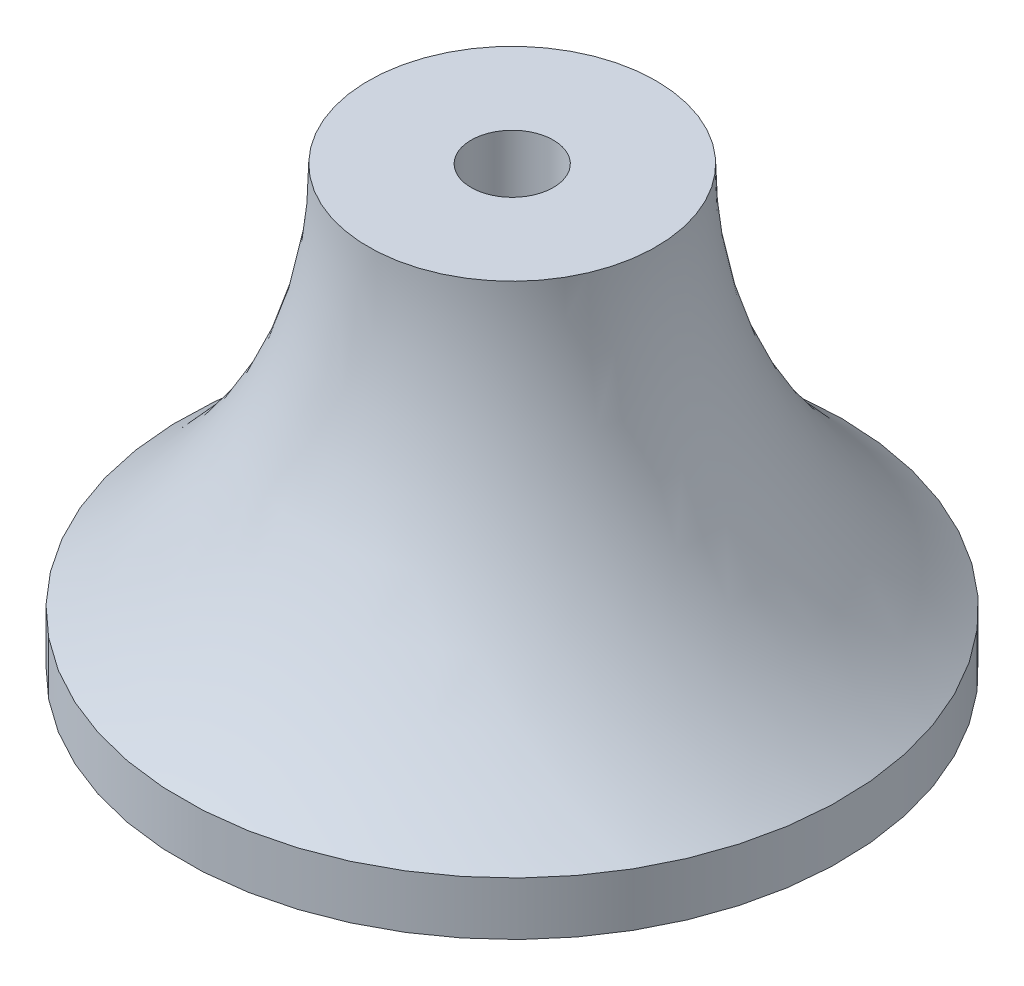
ISO-10303-21;
HEADER;
FILE_DESCRIPTION(('STEP AP214'),'2;1');
FILE_NAME('part.step','',(''),(''),'','','');
FILE_SCHEMA(('AUTOMOTIVE_DESIGN { 1 0 10303 214 1 1 1 1 }'));
ENDSEC;
DATA;
#1=APPLICATION_CONTEXT('core data for automotive mechanical design processes');
#2=APPLICATION_PROTOCOL_DEFINITION('international standard','automotive_design',2000,#1);
#3=PRODUCT_CONTEXT('',#1,'mechanical');
#4=PRODUCT('Part','Part','',(#3));
#5=PRODUCT_RELATED_PRODUCT_CATEGORY('part','',(#4));
#6=PRODUCT_DEFINITION_FORMATION('','',#4);
#7=PRODUCT_DEFINITION_CONTEXT('part definition',#1,'design');
#8=PRODUCT_DEFINITION('design','',#6,#7);
#9=PRODUCT_DEFINITION_SHAPE('','',#8);
#10=(LENGTH_UNIT() NAMED_UNIT(*) SI_UNIT(.MILLI.,.METRE.));
#11=(NAMED_UNIT(*) PLANE_ANGLE_UNIT() SI_UNIT($,.RADIAN.));
#12=(NAMED_UNIT(*) SI_UNIT($,.STERADIAN.) SOLID_ANGLE_UNIT());
#13=UNCERTAINTY_MEASURE_WITH_UNIT(LENGTH_MEASURE(1.E-05),#10,'distance_accuracy_value','');
#14=(GEOMETRIC_REPRESENTATION_CONTEXT(3) GLOBAL_UNCERTAINTY_ASSIGNED_CONTEXT((#13)) GLOBAL_UNIT_ASSIGNED_CONTEXT((#10,
#11,#12)) REPRESENTATION_CONTEXT('',''));
#15=CARTESIAN_POINT('',(0.,0.,0.));
#16=DIRECTION('',(0.,0.,1.));
#17=DIRECTION('',(1.,0.,0.));
#18=AXIS2_PLACEMENT_3D('',#15,#16,#17);
#19=CARTESIAN_POINT('',(0.,0.,0.));
#20=DIRECTION('',(0.,-1.,0.));
#21=DIRECTION('',(0.,0.,-1.));
#22=AXIS2_PLACEMENT_3D('',#19,#20,#21);
#23=CYLINDRICAL_SURFACE('',#22,2.032);
#24=CARTESIAN_POINT('',(0.,19.05,0.));
#25=DIRECTION('',(0.,-1.,0.));
#26=DIRECTION('',(0.,0.,-1.));
#27=AXIS2_PLACEMENT_3D('',#24,#25,#26);
#28=CIRCLE('',#27,2.032);
#29=CARTESIAN_POINT('',(0.,19.05,-2.032));
#30=VERTEX_POINT('',#29);
#31=EDGE_CURVE('E45',#30,#30,#28,.T.);
#32=ORIENTED_EDGE('',*,*,#31,.F.);
#33=EDGE_LOOP('',(#32));
#34=FACE_BOUND('',#33,.T.);
#35=CARTESIAN_POINT('',(0.,13.462,0.));
#36=DIRECTION('',(0.,-1.,0.));
#37=DIRECTION('',(0.,0.,-1.));
#38=AXIS2_PLACEMENT_3D('',#35,#36,#37);
#39=CIRCLE('',#38,2.032);
#40=CARTESIAN_POINT('',(0.,13.462,-2.032));
#41=VERTEX_POINT('',#40);
#42=EDGE_CURVE('E40',#41,#41,#39,.F.);
#43=ORIENTED_EDGE('',*,*,#42,.F.);
#44=EDGE_LOOP('',(#43));
#45=FACE_BOUND('',#44,.T.);
#46=ADVANCED_FACE('F36',(#34,#45),#23,.F.);
#47=CARTESIAN_POINT('',(0.,19.05,0.));
#48=DIRECTION('',(0.,-1.,0.));
#49=DIRECTION('',(0.,0.,-1.));
#50=AXIS2_PLACEMENT_3D('',#47,#48,#49);
#51=TOROIDAL_SURFACE('',#50,31.4619348413196,24.3499348413196);
#52=CARTESIAN_POINT('',(0.,0.,0.));
#53=DIRECTION('',(0.,-1.,0.));
#54=DIRECTION('',(0.,0.,-1.));
#55=AXIS2_PLACEMENT_3D('',#52,#53,#54);
#56=CIRCLE('',#55,16.2956292009696);
#57=CARTESIAN_POINT('',(0.,0.,-16.2956292009696));
#58=VERTEX_POINT('',#57);
#59=EDGE_CURVE('E138',#58,#58,#56,.T.);
#60=ORIENTED_EDGE('',*,*,#59,.F.);
#61=EDGE_LOOP('',(#60));
#62=FACE_BOUND('',#61,.T.);
#63=CARTESIAN_POINT('',(0.,19.05,0.));
#64=DIRECTION('',(0.,-1.,0.));
#65=DIRECTION('',(0.,0.,-1.));
#66=AXIS2_PLACEMENT_3D('',#63,#64,#65);
#67=CIRCLE('',#66,7.112);
#68=CARTESIAN_POINT('',(0.,19.05,-7.112));
#69=VERTEX_POINT('',#68);
#70=EDGE_CURVE('E12',#69,#69,#67,.T.);
#71=ORIENTED_EDGE('',*,*,#70,.T.);
#72=EDGE_LOOP('',(#71));
#73=FACE_BOUND('',#72,.T.);
#74=ADVANCED_FACE('F38',(#62,#73),#51,.F.);
#75=CARTESIAN_POINT('',(0.,19.05,0.));
#76=DIRECTION('',(0.,-1.,0.));
#77=DIRECTION('',(0.,0.,-1.));
#78=AXIS2_PLACEMENT_3D('',#75,#76,#77);
#79=PLANE('',#78);
#80=ORIENTED_EDGE('',*,*,#70,.F.);
#81=EDGE_LOOP('',(#80));
#82=FACE_BOUND('',#81,.T.);
#83=ORIENTED_EDGE('',*,*,#31,.T.);
#84=EDGE_LOOP('',(#83));
#85=FACE_BOUND('',#84,.T.);
#86=ADVANCED_FACE('F147',(#82,#85),#79,.F.);
#87=CARTESIAN_POINT('',(0.,-2.63421929682295,0.));
#88=DIRECTION('',(0.,-1.,0.));
#89=DIRECTION('',(0.,0.,-1.));
#90=AXIS2_PLACEMENT_3D('',#87,#88,#89);
#91=PLANE('',#90);
#92=DIRECTION('',(0.397934450632884,0.,0.917413850451095));
#93=VECTOR('',#92,1.);
#94=CARTESIAN_POINT('',(2.88200941409084,-2.63421929682295,-3.88758662116894));
#95=LINE('',#94,#93);
#96=CARTESIAN_POINT('',(2.88200941409084,-2.63421929682295,-3.88758662116894));
#97=VERTEX_POINT('',#96);
#98=CARTESIAN_POINT('',(4.80775348039024,-2.63421929682295,0.552100055964106));
#99=VERTEX_POINT('',#98);
#100=EDGE_CURVE('E52',#97,#99,#95,.T.);
#101=ORIENTED_EDGE('',*,*,#100,.F.);
#102=DIRECTION('',(0.993470925590789,0.,0.114085581936465));
#103=VECTOR('',#102,1.);
#104=CARTESIAN_POINT('',(-1.92574406629939,-2.63421929682295,-4.43968667713305));
#105=LINE('',#104,#103);
#106=CARTESIAN_POINT('',(-1.92574406629939,-2.63421929682295,-4.43968667713305));
#107=VERTEX_POINT('',#106);
#108=EDGE_CURVE('E126',#107,#97,#105,.T.);
#109=ORIENTED_EDGE('',*,*,#108,.F.);
#110=DIRECTION('',(0.595536474957904,0.,-0.80332826851463));
#111=VECTOR('',#110,1.);
#112=CARTESIAN_POINT('',(-4.80775348039024,-2.63421929682295,-0.552100055964107));
#113=LINE('',#112,#111);
#114=CARTESIAN_POINT('',(-4.80775348039024,-2.63421929682295,-0.552100055964107));
#115=VERTEX_POINT('',#114);
#116=EDGE_CURVE('E120',#115,#107,#113,.T.);
#117=ORIENTED_EDGE('',*,*,#116,.F.);
#118=DIRECTION('',(-0.397934450632884,0.,-0.917413850451095));
#119=VECTOR('',#118,1.);
#120=CARTESIAN_POINT('',(-2.88200941409084,-2.63421929682295,3.88758662116894));
#121=LINE('',#120,#119);
#122=CARTESIAN_POINT('',(-2.88200941409084,-2.63421929682295,3.88758662116894));
#123=VERTEX_POINT('',#122);
#124=EDGE_CURVE('E118',#123,#115,#121,.T.);
#125=ORIENTED_EDGE('',*,*,#124,.F.);
#126=DIRECTION('',(-0.993470925590788,0.,-0.114085581936466));
#127=VECTOR('',#126,1.);
#128=CARTESIAN_POINT('',(1.92574406629939,-2.63421929682295,4.43968667713305));
#129=LINE('',#128,#127);
#130=CARTESIAN_POINT('',(1.92574406629939,-2.63421929682295,4.43968667713305));
#131=VERTEX_POINT('',#130);
#132=EDGE_CURVE('E103',#131,#123,#129,.T.);
#133=ORIENTED_EDGE('',*,*,#132,.F.);
#134=DIRECTION('',(-0.595536474957904,0.,0.80332826851463));
#135=VECTOR('',#134,1.);
#136=CARTESIAN_POINT('',(4.80775348039024,-2.63421929682295,0.552100055964106));
#137=LINE('',#136,#135);
#138=EDGE_CURVE('E110',#99,#131,#137,.T.);
#139=ORIENTED_EDGE('',*,*,#138,.F.);
#140=EDGE_LOOP('',(#101,#109,#117,#125,#133,#139));
#141=FACE_BOUND('',#140,.T.);
#142=CARTESIAN_POINT('',(0.,-2.63421929682295,0.));
#143=DIRECTION('',(0.,-1.,0.));
#144=DIRECTION('',(0.,0.,-1.));
#145=AXIS2_PLACEMENT_3D('',#142,#143,#144);
#146=CIRCLE('',#145,16.2956292009696);
#147=CARTESIAN_POINT('',(0.,-2.63421929682295,-16.2956292009696));
#148=VERTEX_POINT('',#147);
#149=EDGE_CURVE('E141',#148,#148,#146,.T.);
#150=ORIENTED_EDGE('',*,*,#149,.T.);
#151=EDGE_LOOP('',(#150));
#152=FACE_BOUND('',#151,.T.);
#153=ADVANCED_FACE('F114',(#141,#152),#91,.T.);
#154=CARTESIAN_POINT('',(0.,0.,0.));
#155=DIRECTION('',(0.,-1.,0.));
#156=DIRECTION('',(0.,0.,-1.));
#157=AXIS2_PLACEMENT_3D('',#154,#155,#156);
#158=CYLINDRICAL_SURFACE('',#157,16.2956292009696);
#159=ORIENTED_EDGE('',*,*,#149,.F.);
#160=EDGE_LOOP('',(#159));
#161=FACE_BOUND('',#160,.T.);
#162=ORIENTED_EDGE('',*,*,#59,.T.);
#163=EDGE_LOOP('',(#162));
#164=FACE_BOUND('',#163,.T.);
#165=ADVANCED_FACE('F158',(#161,#164),#158,.T.);
#166=CARTESIAN_POINT('',(0.,13.462,0.));
#167=DIRECTION('',(0.,-1.,0.));
#168=DIRECTION('',(0.,0.,-1.));
#169=AXIS2_PLACEMENT_3D('',#166,#167,#168);
#170=PLANE('',#169);
#171=DIRECTION('',(-0.397934450632884,0.,-0.917413850451095));
#172=VECTOR('',#171,1.);
#173=CARTESIAN_POINT('',(2.88200941409084,13.462,-3.88758662116894));
#174=LINE('',#173,#172);
#175=CARTESIAN_POINT('',(4.80775348039024,13.462,0.552100055964106));
#176=VERTEX_POINT('',#175);
#177=CARTESIAN_POINT('',(2.88200941409084,13.462,-3.88758662116894));
#178=VERTEX_POINT('',#177);
#179=EDGE_CURVE('E71',#176,#178,#174,.T.);
#180=ORIENTED_EDGE('',*,*,#179,.F.);
#181=DIRECTION('',(0.595536474957904,0.,-0.80332826851463));
#182=VECTOR('',#181,1.);
#183=CARTESIAN_POINT('',(4.80775348039024,13.462,0.552100055964106));
#184=LINE('',#183,#182);
#185=CARTESIAN_POINT('',(1.92574406629939,13.462,4.43968667713305));
#186=VERTEX_POINT('',#185);
#187=EDGE_CURVE('E80',#186,#176,#184,.T.);
#188=ORIENTED_EDGE('',*,*,#187,.F.);
#189=DIRECTION('',(0.993470925590789,0.,0.114085581936466));
#190=VECTOR('',#189,1.);
#191=CARTESIAN_POINT('',(1.92574406629939,13.462,4.43968667713305));
#192=LINE('',#191,#190);
#193=CARTESIAN_POINT('',(-2.88200941409084,13.462,3.88758662116894));
#194=VERTEX_POINT('',#193);
#195=EDGE_CURVE('E105',#194,#186,#192,.T.);
#196=ORIENTED_EDGE('',*,*,#195,.F.);
#197=DIRECTION('',(0.397934450632884,0.,0.917413850451095));
#198=VECTOR('',#197,1.);
#199=CARTESIAN_POINT('',(-2.88200941409084,13.462,3.88758662116894));
#200=LINE('',#199,#198);
#201=CARTESIAN_POINT('',(-4.80775348039024,13.462,-0.552100055964108));
#202=VERTEX_POINT('',#201);
#203=EDGE_CURVE('E61',#202,#194,#200,.T.);
#204=ORIENTED_EDGE('',*,*,#203,.F.);
#205=DIRECTION('',(-0.595536474957905,0.,0.80332826851463));
#206=VECTOR('',#205,1.);
#207=CARTESIAN_POINT('',(-4.80775348039024,13.462,-0.552100055964107));
#208=LINE('',#207,#206);
#209=CARTESIAN_POINT('',(-1.92574406629939,13.462,-4.43968667713305));
#210=VERTEX_POINT('',#209);
#211=EDGE_CURVE('E265',#210,#202,#208,.T.);
#212=ORIENTED_EDGE('',*,*,#211,.F.);
#213=DIRECTION('',(-0.993470925590789,0.,-0.114085581936465));
#214=VECTOR('',#213,1.);
#215=CARTESIAN_POINT('',(-1.92574406629939,13.462,-4.43968667713305));
#216=LINE('',#215,#214);
#217=EDGE_CURVE('E266',#178,#210,#216,.T.);
#218=ORIENTED_EDGE('',*,*,#217,.F.);
#219=EDGE_LOOP('',(#180,#188,#196,#204,#212,#218));
#220=FACE_BOUND('',#219,.T.);
#221=ORIENTED_EDGE('',*,*,#42,.T.);
#222=EDGE_LOOP('',(#221));
#223=FACE_BOUND('',#222,.T.);
#224=ADVANCED_FACE('F155',(#220,#223),#170,.T.);
#225=CARTESIAN_POINT('',(2.88200941409084,32.138210163245,-3.88758662116894));
#226=DIRECTION('',(0.917413850451095,0.,-0.397934450632884));
#227=DIRECTION('',(-0.397934450632884,0.,-0.917413850451095));
#228=AXIS2_PLACEMENT_3D('',#225,#226,#227);
#229=PLANE('',#228);
#230=ORIENTED_EDGE('',*,*,#179,.T.);
#231=DIRECTION('',(0.,-1.,0.));
#232=VECTOR('',#231,1.);
#233=CARTESIAN_POINT('',(2.88200941409084,32.138210163245,-3.88758662116894));
#234=LINE('',#233,#232);
#235=EDGE_CURVE('E129',#178,#97,#234,.T.);
#236=ORIENTED_EDGE('',*,*,#235,.T.);
#237=ORIENTED_EDGE('',*,*,#100,.T.);
#238=DIRECTION('',(0.,-1.,0.));
#239=VECTOR('',#238,1.);
#240=CARTESIAN_POINT('',(4.80775348039024,32.138210163245,0.552100055964106));
#241=LINE('',#240,#239);
#242=EDGE_CURVE('E107',#176,#99,#241,.T.);
#243=ORIENTED_EDGE('',*,*,#242,.F.);
#244=EDGE_LOOP('',(#230,#236,#237,#243));
#245=FACE_BOUND('',#244,.T.);
#246=ADVANCED_FACE('F157',(#245),#229,.F.);
#247=CARTESIAN_POINT('',(-1.92574406629939,32.138210163245,-4.43968667713305));
#248=DIRECTION('',(0.114085581936465,0.,-0.993470925590788));
#249=DIRECTION('',(-0.993470925590789,0.,-0.114085581936465));
#250=AXIS2_PLACEMENT_3D('',#247,#248,#249);
#251=PLANE('',#250);
#252=ORIENTED_EDGE('',*,*,#217,.T.);
#253=DIRECTION('',(0.,-1.,0.));
#254=VECTOR('',#253,1.);
#255=CARTESIAN_POINT('',(-1.92574406629939,32.138210163245,-4.43968667713305));
#256=LINE('',#255,#254);
#257=EDGE_CURVE('E131',#210,#107,#256,.T.);
#258=ORIENTED_EDGE('',*,*,#257,.T.);
#259=ORIENTED_EDGE('',*,*,#108,.T.);
#260=ORIENTED_EDGE('',*,*,#235,.F.);
#261=EDGE_LOOP('',(#252,#258,#259,#260));
#262=FACE_BOUND('',#261,.T.);
#263=ADVANCED_FACE('F165',(#262),#251,.F.);
#264=CARTESIAN_POINT('',(-4.80775348039024,32.138210163245,-0.552100055964107));
#265=DIRECTION('',(-0.80332826851463,0.,-0.595536474957904));
#266=DIRECTION('',(-0.595536474957905,0.,0.80332826851463));
#267=AXIS2_PLACEMENT_3D('',#264,#265,#266);
#268=PLANE('',#267);
#269=ORIENTED_EDGE('',*,*,#211,.T.);
#270=DIRECTION('',(0.,-1.,0.));
#271=VECTOR('',#270,1.);
#272=CARTESIAN_POINT('',(-4.80775348039024,32.138210163245,-0.552100055964107));
#273=LINE('',#272,#271);
#274=EDGE_CURVE('E133',#202,#115,#273,.T.);
#275=ORIENTED_EDGE('',*,*,#274,.T.);
#276=ORIENTED_EDGE('',*,*,#116,.T.);
#277=ORIENTED_EDGE('',*,*,#257,.F.);
#278=EDGE_LOOP('',(#269,#275,#276,#277));
#279=FACE_BOUND('',#278,.T.);
#280=ADVANCED_FACE('F172',(#279),#268,.F.);
#281=CARTESIAN_POINT('',(-2.88200941409084,32.138210163245,3.88758662116894));
#282=DIRECTION('',(-0.917413850451095,0.,0.397934450632884));
#283=DIRECTION('',(0.397934450632884,0.,0.917413850451095));
#284=AXIS2_PLACEMENT_3D('',#281,#282,#283);
#285=PLANE('',#284);
#286=ORIENTED_EDGE('',*,*,#203,.T.);
#287=DIRECTION('',(0.,-1.,0.));
#288=VECTOR('',#287,1.);
#289=CARTESIAN_POINT('',(-2.88200941409084,32.138210163245,3.88758662116894));
#290=LINE('',#289,#288);
#291=EDGE_CURVE('E106',#194,#123,#290,.T.);
#292=ORIENTED_EDGE('',*,*,#291,.T.);
#293=ORIENTED_EDGE('',*,*,#124,.T.);
#294=ORIENTED_EDGE('',*,*,#274,.F.);
#295=EDGE_LOOP('',(#286,#292,#293,#294));
#296=FACE_BOUND('',#295,.T.);
#297=ADVANCED_FACE('F176',(#296),#285,.F.);
#298=CARTESIAN_POINT('',(1.92574406629939,32.138210163245,4.43968667713305));
#299=DIRECTION('',(-0.114085581936466,0.,0.993470925590788));
#300=DIRECTION('',(0.993470925590789,0.,0.114085581936466));
#301=AXIS2_PLACEMENT_3D('',#298,#299,#300);
#302=PLANE('',#301);
#303=ORIENTED_EDGE('',*,*,#195,.T.);
#304=DIRECTION('',(0.,-1.,0.));
#305=VECTOR('',#304,1.);
#306=CARTESIAN_POINT('',(1.92574406629939,32.138210163245,4.43968667713305));
#307=LINE('',#306,#305);
#308=EDGE_CURVE('E98',#186,#131,#307,.T.);
#309=ORIENTED_EDGE('',*,*,#308,.T.);
#310=ORIENTED_EDGE('',*,*,#132,.T.);
#311=ORIENTED_EDGE('',*,*,#291,.F.);
#312=EDGE_LOOP('',(#303,#309,#310,#311));
#313=FACE_BOUND('',#312,.T.);
#314=ADVANCED_FACE('F100',(#313),#302,.F.);
#315=CARTESIAN_POINT('',(4.80775348039024,32.138210163245,0.552100055964106));
#316=DIRECTION('',(0.80332826851463,0.,0.595536474957904));
#317=DIRECTION('',(0.595536474957904,0.,-0.80332826851463));
#318=AXIS2_PLACEMENT_3D('',#315,#316,#317);
#319=PLANE('',#318);
#320=ORIENTED_EDGE('',*,*,#187,.T.);
#321=ORIENTED_EDGE('',*,*,#242,.T.);
#322=ORIENTED_EDGE('',*,*,#138,.T.);
#323=ORIENTED_EDGE('',*,*,#308,.F.);
#324=EDGE_LOOP('',(#320,#321,#322,#323));
#325=FACE_BOUND('',#324,.T.);
#326=ADVANCED_FACE('F111',(#325),#319,.F.);
#327=CLOSED_SHELL('',(#46,#74,#86,#153,#165,#224,#246,#263,#280,#297,#314,#326));
#328=MANIFOLD_SOLID_BREP('B2',#327);
#329=ADVANCED_BREP_SHAPE_REPRESENTATION('',(#18,#328),#14);
#330=SHAPE_DEFINITION_REPRESENTATION(#9,#329);
ENDSEC;
END-ISO-10303-21;
